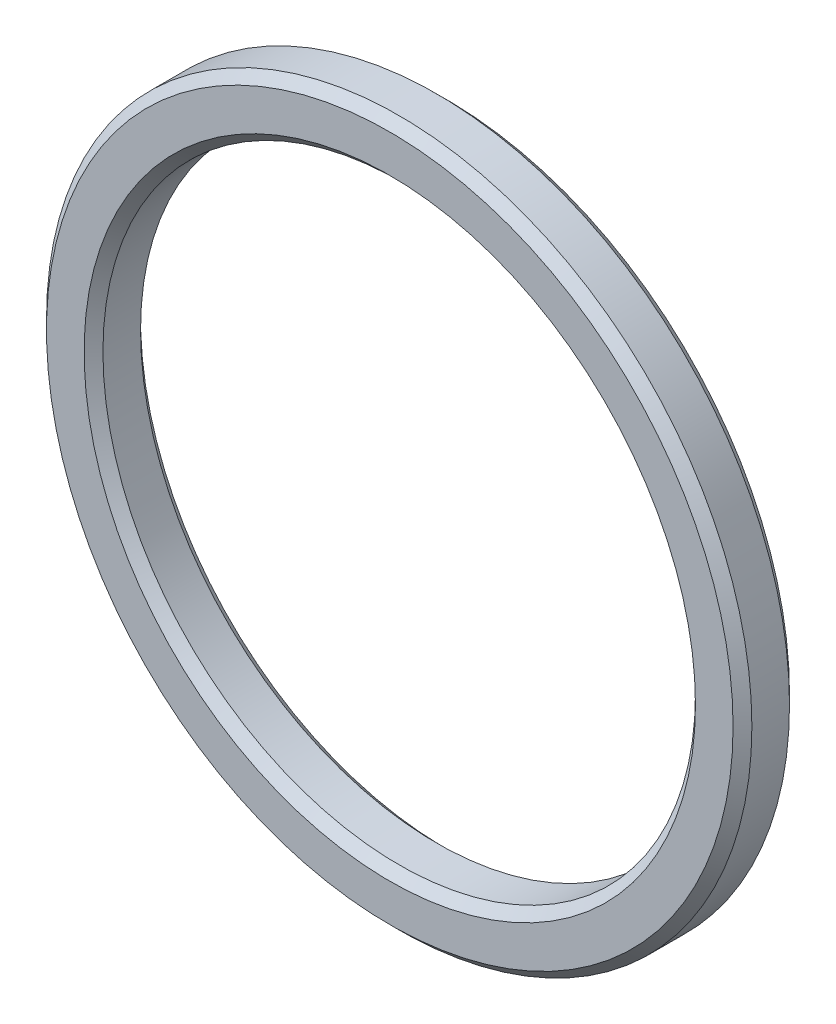
ISO-10303-21;
HEADER;
FILE_DESCRIPTION(('STEP AP214'),'2;1');
FILE_NAME('part.step','',(''),(''),'','','');
FILE_SCHEMA(('AUTOMOTIVE_DESIGN { 1 0 10303 214 1 1 1 1 }'));
ENDSEC;
DATA;
#1=APPLICATION_CONTEXT('core data for automotive mechanical design processes');
#2=APPLICATION_PROTOCOL_DEFINITION('international standard','automotive_design',2000,#1);
#3=PRODUCT_CONTEXT('',#1,'mechanical');
#4=PRODUCT('Part','Part','',(#3));
#5=PRODUCT_RELATED_PRODUCT_CATEGORY('part','',(#4));
#6=PRODUCT_DEFINITION_FORMATION('','',#4);
#7=PRODUCT_DEFINITION_CONTEXT('part definition',#1,'design');
#8=PRODUCT_DEFINITION('design','',#6,#7);
#9=PRODUCT_DEFINITION_SHAPE('','',#8);
#10=(LENGTH_UNIT() NAMED_UNIT(*) SI_UNIT(.MILLI.,.METRE.));
#11=(NAMED_UNIT(*) PLANE_ANGLE_UNIT() SI_UNIT($,.RADIAN.));
#12=(NAMED_UNIT(*) SI_UNIT($,.STERADIAN.) SOLID_ANGLE_UNIT());
#13=UNCERTAINTY_MEASURE_WITH_UNIT(LENGTH_MEASURE(1.E-05),#10,'distance_accuracy_value','');
#14=(GEOMETRIC_REPRESENTATION_CONTEXT(3) GLOBAL_UNCERTAINTY_ASSIGNED_CONTEXT((#13)) GLOBAL_UNIT_ASSIGNED_CONTEXT((#10,
#11,#12)) REPRESENTATION_CONTEXT('',''));
#15=CARTESIAN_POINT('',(0.,0.,0.));
#16=DIRECTION('',(0.,0.,1.));
#17=DIRECTION('',(1.,0.,0.));
#18=AXIS2_PLACEMENT_3D('',#15,#16,#17);
#19=CARTESIAN_POINT('',(0.,0.,3.));
#20=DIRECTION('',(0.,0.,1.));
#21=DIRECTION('',(1.,0.,0.));
#22=AXIS2_PLACEMENT_3D('',#19,#20,#21);
#23=PLANE('',#22);
#24=CARTESIAN_POINT('',(0.,0.,3.));
#25=DIRECTION('',(0.,0.,1.));
#26=DIRECTION('',(1.,0.,0.));
#27=AXIS2_PLACEMENT_3D('',#24,#25,#26);
#28=CIRCLE('',#27,18.25);
#29=CARTESIAN_POINT('',(18.25,0.,3.));
#30=VERTEX_POINT('',#29);
#31=EDGE_CURVE('E59',#30,#30,#28,.T.);
#32=ORIENTED_EDGE('',*,*,#31,.T.);
#33=EDGE_LOOP('',(#32));
#34=FACE_BOUND('',#33,.T.);
#35=CARTESIAN_POINT('',(0.,0.,3.));
#36=DIRECTION('',(0.,0.,1.));
#37=DIRECTION('',(1.,0.,0.));
#38=AXIS2_PLACEMENT_3D('',#35,#36,#37);
#39=CIRCLE('',#38,16.25);
#40=CARTESIAN_POINT('',(16.25,0.,3.));
#41=VERTEX_POINT('',#40);
#42=EDGE_CURVE('E64',#41,#41,#39,.F.);
#43=ORIENTED_EDGE('',*,*,#42,.T.);
#44=EDGE_LOOP('',(#43));
#45=FACE_BOUND('',#44,.T.);
#46=ADVANCED_FACE('F45',(#34,#45),#23,.T.);
#47=CARTESIAN_POINT('',(0.,0.,0.));
#48=DIRECTION('',(0.,0.,1.));
#49=DIRECTION('',(1.,0.,0.));
#50=AXIS2_PLACEMENT_3D('',#47,#48,#49);
#51=PLANE('',#50);
#52=CARTESIAN_POINT('',(0.,0.,0.));
#53=DIRECTION('',(0.,0.,1.));
#54=DIRECTION('',(1.,0.,0.));
#55=AXIS2_PLACEMENT_3D('',#52,#53,#54);
#56=CIRCLE('',#55,18.25);
#57=CARTESIAN_POINT('',(18.25,0.,0.));
#58=VERTEX_POINT('',#57);
#59=EDGE_CURVE('E70',#58,#58,#56,.F.);
#60=ORIENTED_EDGE('',*,*,#59,.T.);
#61=EDGE_LOOP('',(#60));
#62=FACE_BOUND('',#61,.T.);
#63=CARTESIAN_POINT('',(0.,0.,0.));
#64=DIRECTION('',(0.,0.,1.));
#65=DIRECTION('',(1.,0.,0.));
#66=AXIS2_PLACEMENT_3D('',#63,#64,#65);
#67=CIRCLE('',#66,16.25);
#68=CARTESIAN_POINT('',(16.25,0.,0.));
#69=VERTEX_POINT('',#68);
#70=EDGE_CURVE('E74',#69,#69,#67,.T.);
#71=ORIENTED_EDGE('',*,*,#70,.T.);
#72=EDGE_LOOP('',(#71));
#73=FACE_BOUND('',#72,.T.);
#74=ADVANCED_FACE('F99',(#62,#73),#51,.F.);
#75=CARTESIAN_POINT('',(0.,0.,3.));
#76=DIRECTION('',(0.,0.,-1.));
#77=DIRECTION('',(-1.,0.,0.));
#78=AXIS2_PLACEMENT_3D('',#75,#76,#77);
#79=CYLINDRICAL_SURFACE('',#78,18.75);
#80=CARTESIAN_POINT('',(0.,0.,0.499999999999994));
#81=DIRECTION('',(0.,0.,1.));
#82=DIRECTION('',(1.,0.,0.));
#83=AXIS2_PLACEMENT_3D('',#80,#81,#82);
#84=CIRCLE('',#83,18.75);
#85=CARTESIAN_POINT('',(18.75,0.,0.499999999999994));
#86=VERTEX_POINT('',#85);
#87=EDGE_CURVE('E78',#86,#86,#84,.T.);
#88=ORIENTED_EDGE('',*,*,#87,.T.);
#89=EDGE_LOOP('',(#88));
#90=FACE_BOUND('',#89,.T.);
#91=CARTESIAN_POINT('',(0.,0.,2.5));
#92=DIRECTION('',(0.,0.,1.));
#93=DIRECTION('',(1.,0.,0.));
#94=AXIS2_PLACEMENT_3D('',#91,#92,#93);
#95=CIRCLE('',#94,18.75);
#96=CARTESIAN_POINT('',(18.75,0.,2.5));
#97=VERTEX_POINT('',#96);
#98=EDGE_CURVE('E82',#97,#97,#95,.F.);
#99=ORIENTED_EDGE('',*,*,#98,.T.);
#100=EDGE_LOOP('',(#99));
#101=FACE_BOUND('',#100,.T.);
#102=ADVANCED_FACE('F87',(#90,#101),#79,.T.);
#103=CARTESIAN_POINT('',(0.,0.,3.));
#104=DIRECTION('',(0.,0.,-1.));
#105=DIRECTION('',(-1.,0.,0.));
#106=AXIS2_PLACEMENT_3D('',#103,#104,#105);
#107=CYLINDRICAL_SURFACE('',#106,15.75);
#108=CARTESIAN_POINT('',(0.,0.,0.500000000000007));
#109=DIRECTION('',(0.,0.,1.));
#110=DIRECTION('',(1.,0.,0.));
#111=AXIS2_PLACEMENT_3D('',#108,#109,#110);
#112=CIRCLE('',#111,15.75);
#113=CARTESIAN_POINT('',(15.75,0.,0.500000000000007));
#114=VERTEX_POINT('',#113);
#115=EDGE_CURVE('E10',#114,#114,#112,.F.);
#116=ORIENTED_EDGE('',*,*,#115,.T.);
#117=EDGE_LOOP('',(#116));
#118=FACE_BOUND('',#117,.T.);
#119=CARTESIAN_POINT('',(0.,0.,2.49999999999998));
#120=DIRECTION('',(0.,0.,1.));
#121=DIRECTION('',(1.,0.,0.));
#122=AXIS2_PLACEMENT_3D('',#119,#120,#121);
#123=CIRCLE('',#122,15.75);
#124=CARTESIAN_POINT('',(15.75,0.,2.49999999999998));
#125=VERTEX_POINT('',#124);
#126=EDGE_CURVE('E54',#125,#125,#123,.T.);
#127=ORIENTED_EDGE('',*,*,#126,.T.);
#128=EDGE_LOOP('',(#127));
#129=FACE_BOUND('',#128,.T.);
#130=ADVANCED_FACE('F124',(#118,#129),#107,.F.);
#131=CARTESIAN_POINT('',(0.,0.,0.499999999999994));
#132=DIRECTION('',(0.,0.,1.));
#133=DIRECTION('',(1.,0.,0.));
#134=AXIS2_PLACEMENT_3D('',#131,#132,#133);
#135=CONICAL_SURFACE('',#134,18.75,0.785398163397452);
#136=ORIENTED_EDGE('',*,*,#59,.F.);
#137=EDGE_LOOP('',(#136));
#138=FACE_BOUND('',#137,.T.);
#139=ORIENTED_EDGE('',*,*,#87,.F.);
#140=EDGE_LOOP('',(#139));
#141=FACE_BOUND('',#140,.T.);
#142=ADVANCED_FACE('F93',(#138,#141),#135,.T.);
#143=CARTESIAN_POINT('',(0.,0.,3.));
#144=DIRECTION('',(0.,0.,-1.));
#145=DIRECTION('',(-1.,0.,0.));
#146=AXIS2_PLACEMENT_3D('',#143,#144,#145);
#147=CONICAL_SURFACE('',#146,18.25,0.785398163397448);
#148=ORIENTED_EDGE('',*,*,#98,.F.);
#149=EDGE_LOOP('',(#148));
#150=FACE_BOUND('',#149,.T.);
#151=ORIENTED_EDGE('',*,*,#31,.F.);
#152=EDGE_LOOP('',(#151));
#153=FACE_BOUND('',#152,.T.);
#154=ADVANCED_FACE('F89',(#150,#153),#147,.T.);
#155=CARTESIAN_POINT('',(0.,0.,0.));
#156=DIRECTION('',(0.,0.,-1.));
#157=DIRECTION('',(-1.,0.,0.));
#158=AXIS2_PLACEMENT_3D('',#155,#156,#157);
#159=CONICAL_SURFACE('',#158,16.25,0.785398163397445);
#160=ORIENTED_EDGE('',*,*,#115,.F.);
#161=EDGE_LOOP('',(#160));
#162=FACE_BOUND('',#161,.T.);
#163=ORIENTED_EDGE('',*,*,#70,.F.);
#164=EDGE_LOOP('',(#163));
#165=FACE_BOUND('',#164,.T.);
#166=ADVANCED_FACE('F92',(#162,#165),#159,.F.);
#167=CARTESIAN_POINT('',(0.,0.,2.49999999999998));
#168=DIRECTION('',(0.,0.,1.));
#169=DIRECTION('',(1.,0.,0.));
#170=AXIS2_PLACEMENT_3D('',#167,#168,#169);
#171=CONICAL_SURFACE('',#170,15.75,0.785398163397448);
#172=ORIENTED_EDGE('',*,*,#42,.F.);
#173=EDGE_LOOP('',(#172));
#174=FACE_BOUND('',#173,.T.);
#175=ORIENTED_EDGE('',*,*,#126,.F.);
#176=EDGE_LOOP('',(#175));
#177=FACE_BOUND('',#176,.T.);
#178=ADVANCED_FACE('F48',(#174,#177),#171,.F.);
#179=CLOSED_SHELL('',(#46,#74,#102,#130,#142,#154,#166,#178));
#180=MANIFOLD_SOLID_BREP('B2',#179);
#181=ADVANCED_BREP_SHAPE_REPRESENTATION('',(#18,#180),#14);
#182=SHAPE_DEFINITION_REPRESENTATION(#9,#181);
ENDSEC;
END-ISO-10303-21;
